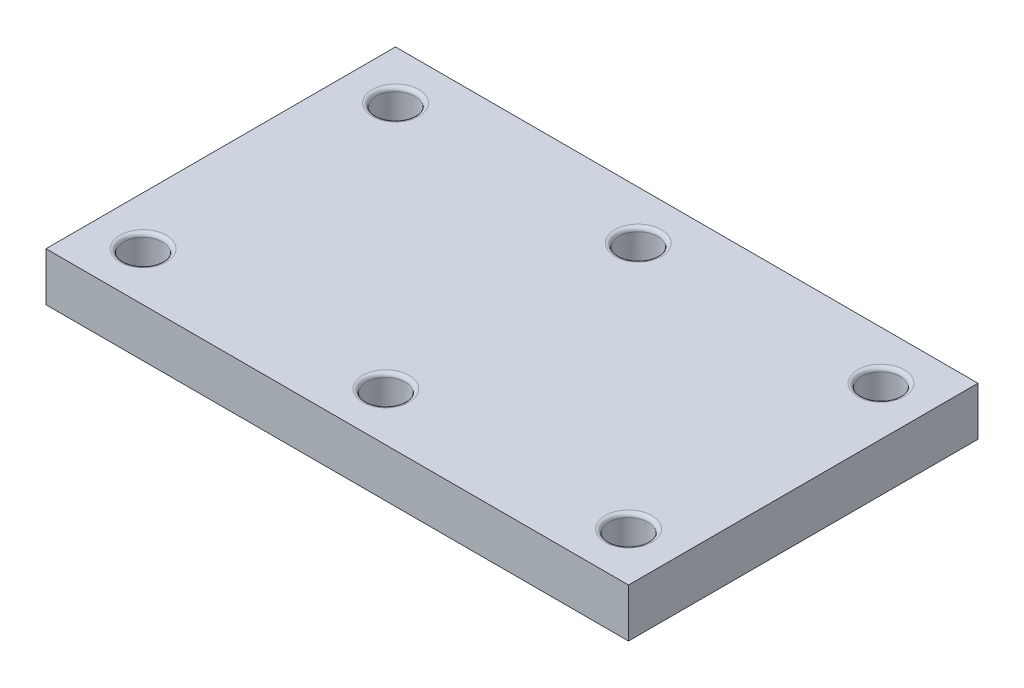
ISO-10303-21;
HEADER;
FILE_DESCRIPTION(('STEP AP214'),'2;1');
FILE_NAME('part.step','',(''),(''),'','','');
FILE_SCHEMA(('AUTOMOTIVE_DESIGN { 1 0 10303 214 1 1 1 1 }'));
ENDSEC;
DATA;
#1=APPLICATION_CONTEXT('core data for automotive mechanical design processes');
#2=APPLICATION_PROTOCOL_DEFINITION('international standard','automotive_design',2000,#1);
#3=PRODUCT_CONTEXT('',#1,'mechanical');
#4=PRODUCT('Part','Part','',(#3));
#5=PRODUCT_RELATED_PRODUCT_CATEGORY('part','',(#4));
#6=PRODUCT_DEFINITION_FORMATION('','',#4);
#7=PRODUCT_DEFINITION_CONTEXT('part definition',#1,'design');
#8=PRODUCT_DEFINITION('design','',#6,#7);
#9=PRODUCT_DEFINITION_SHAPE('','',#8);
#10=(LENGTH_UNIT() NAMED_UNIT(*) SI_UNIT(.MILLI.,.METRE.));
#11=(NAMED_UNIT(*) PLANE_ANGLE_UNIT() SI_UNIT($,.RADIAN.));
#12=(NAMED_UNIT(*) SI_UNIT($,.STERADIAN.) SOLID_ANGLE_UNIT());
#13=UNCERTAINTY_MEASURE_WITH_UNIT(LENGTH_MEASURE(1.E-05),#10,'distance_accuracy_value','');
#14=(GEOMETRIC_REPRESENTATION_CONTEXT(3) GLOBAL_UNCERTAINTY_ASSIGNED_CONTEXT((#13)) GLOBAL_UNIT_ASSIGNED_CONTEXT((#10,
#11,#12)) REPRESENTATION_CONTEXT('',''));
#15=CARTESIAN_POINT('',(0.,0.,0.));
#16=DIRECTION('',(0.,0.,1.));
#17=DIRECTION('',(1.,0.,0.));
#18=AXIS2_PLACEMENT_3D('',#15,#16,#17);
#19=CARTESIAN_POINT('',(150.,25.,90.));
#20=DIRECTION('',(-1.,0.,0.));
#21=DIRECTION('',(0.,0.,1.));
#22=AXIS2_PLACEMENT_3D('',#19,#20,#21);
#23=PLANE('',#22);
#24=DIRECTION('',(0.,0.,-1.));
#25=VECTOR('',#24,1.);
#26=CARTESIAN_POINT('',(150.,0.,90.));
#27=LINE('',#26,#25);
#28=CARTESIAN_POINT('',(150.,0.,90.));
#29=VERTEX_POINT('',#28);
#30=CARTESIAN_POINT('',(150.,0.,-90.));
#31=VERTEX_POINT('',#30);
#32=EDGE_CURVE('E101',#29,#31,#27,.T.);
#33=ORIENTED_EDGE('',*,*,#32,.T.);
#34=DIRECTION('',(0.,-1.,0.));
#35=VECTOR('',#34,1.);
#36=CARTESIAN_POINT('',(150.,25.,-90.));
#37=LINE('',#36,#35);
#38=CARTESIAN_POINT('',(150.,25.,-90.));
#39=VERTEX_POINT('',#38);
#40=EDGE_CURVE('E92',#39,#31,#37,.T.);
#41=ORIENTED_EDGE('',*,*,#40,.F.);
#42=DIRECTION('',(0.,0.,-1.));
#43=VECTOR('',#42,1.);
#44=CARTESIAN_POINT('',(150.,25.,90.));
#45=LINE('',#44,#43);
#46=CARTESIAN_POINT('',(150.,25.,90.));
#47=VERTEX_POINT('',#46);
#48=EDGE_CURVE('E86',#47,#39,#45,.T.);
#49=ORIENTED_EDGE('',*,*,#48,.F.);
#50=DIRECTION('',(0.,-1.,0.));
#51=VECTOR('',#50,1.);
#52=CARTESIAN_POINT('',(150.,25.,90.));
#53=LINE('',#52,#51);
#54=EDGE_CURVE('E97',#47,#29,#53,.T.);
#55=ORIENTED_EDGE('',*,*,#54,.T.);
#56=EDGE_LOOP('',(#33,#41,#49,#55));
#57=FACE_BOUND('',#56,.T.);
#58=ADVANCED_FACE('F33',(#57),#23,.F.);
#59=CARTESIAN_POINT('',(-150.,25.,-90.));
#60=DIRECTION('',(0.,0.,1.));
#61=DIRECTION('',(1.,0.,0.));
#62=AXIS2_PLACEMENT_3D('',#59,#60,#61);
#63=PLANE('',#62);
#64=DIRECTION('',(-1.,0.,0.));
#65=VECTOR('',#64,1.);
#66=CARTESIAN_POINT('',(-150.,0.,-90.));
#67=LINE('',#66,#65);
#68=CARTESIAN_POINT('',(-150.,0.,-90.));
#69=VERTEX_POINT('',#68);
#70=EDGE_CURVE('E91',#31,#69,#67,.T.);
#71=ORIENTED_EDGE('',*,*,#70,.T.);
#72=DIRECTION('',(0.,-1.,0.));
#73=VECTOR('',#72,1.);
#74=CARTESIAN_POINT('',(-150.,25.,-90.));
#75=LINE('',#74,#73);
#76=CARTESIAN_POINT('',(-150.,25.,-90.));
#77=VERTEX_POINT('',#76);
#78=EDGE_CURVE('E89',#77,#69,#75,.T.);
#79=ORIENTED_EDGE('',*,*,#78,.F.);
#80=DIRECTION('',(-1.,0.,0.));
#81=VECTOR('',#80,1.);
#82=CARTESIAN_POINT('',(-150.,25.,-90.));
#83=LINE('',#82,#81);
#84=EDGE_CURVE('E81',#39,#77,#83,.T.);
#85=ORIENTED_EDGE('',*,*,#84,.F.);
#86=ORIENTED_EDGE('',*,*,#40,.T.);
#87=EDGE_LOOP('',(#71,#79,#85,#86));
#88=FACE_BOUND('',#87,.T.);
#89=ADVANCED_FACE('F90',(#88),#63,.F.);
#90=CARTESIAN_POINT('',(-150.,25.,90.));
#91=DIRECTION('',(1.,0.,0.));
#92=DIRECTION('',(0.,0.,-1.));
#93=AXIS2_PLACEMENT_3D('',#90,#91,#92);
#94=PLANE('',#93);
#95=DIRECTION('',(0.,0.,1.));
#96=VECTOR('',#95,1.);
#97=CARTESIAN_POINT('',(-150.,0.,90.));
#98=LINE('',#97,#96);
#99=CARTESIAN_POINT('',(-150.,0.,90.));
#100=VERTEX_POINT('',#99);
#101=EDGE_CURVE('E67',#69,#100,#98,.T.);
#102=ORIENTED_EDGE('',*,*,#101,.T.);
#103=DIRECTION('',(0.,-1.,0.));
#104=VECTOR('',#103,1.);
#105=CARTESIAN_POINT('',(-150.,25.,90.));
#106=LINE('',#105,#104);
#107=CARTESIAN_POINT('',(-150.,25.,90.));
#108=VERTEX_POINT('',#107);
#109=EDGE_CURVE('E93',#108,#100,#106,.T.);
#110=ORIENTED_EDGE('',*,*,#109,.F.);
#111=DIRECTION('',(0.,0.,1.));
#112=VECTOR('',#111,1.);
#113=CARTESIAN_POINT('',(-150.,25.,90.));
#114=LINE('',#113,#112);
#115=EDGE_CURVE('E84',#77,#108,#114,.T.);
#116=ORIENTED_EDGE('',*,*,#115,.F.);
#117=ORIENTED_EDGE('',*,*,#78,.T.);
#118=EDGE_LOOP('',(#102,#110,#116,#117));
#119=FACE_BOUND('',#118,.T.);
#120=ADVANCED_FACE('F95',(#119),#94,.F.);
#121=CARTESIAN_POINT('',(-150.,25.,90.));
#122=DIRECTION('',(0.,0.,-1.));
#123=DIRECTION('',(-1.,0.,0.));
#124=AXIS2_PLACEMENT_3D('',#121,#122,#123);
#125=PLANE('',#124);
#126=DIRECTION('',(1.,0.,0.));
#127=VECTOR('',#126,1.);
#128=CARTESIAN_POINT('',(-150.,0.,90.));
#129=LINE('',#128,#127);
#130=EDGE_CURVE('E73',#100,#29,#129,.T.);
#131=ORIENTED_EDGE('',*,*,#130,.T.);
#132=ORIENTED_EDGE('',*,*,#54,.F.);
#133=DIRECTION('',(1.,0.,0.));
#134=VECTOR('',#133,1.);
#135=CARTESIAN_POINT('',(-150.,25.,90.));
#136=LINE('',#135,#134);
#137=EDGE_CURVE('E50',#108,#47,#136,.T.);
#138=ORIENTED_EDGE('',*,*,#137,.F.);
#139=ORIENTED_EDGE('',*,*,#109,.T.);
#140=EDGE_LOOP('',(#131,#132,#138,#139));
#141=FACE_BOUND('',#140,.T.);
#142=ADVANCED_FACE('F155',(#141),#125,.F.);
#143=CARTESIAN_POINT('',(0.,25.,0.));
#144=DIRECTION('',(0.,-1.,0.));
#145=DIRECTION('',(0.,0.,-1.));
#146=AXIS2_PLACEMENT_3D('',#143,#144,#145);
#147=PLANE('',#146);
#148=CARTESIAN_POINT('',(-125.,25.,-65.));
#149=DIRECTION('',(0.,-1.,0.));
#150=DIRECTION('',(0.,0.,-1.));
#151=AXIS2_PLACEMENT_3D('',#148,#149,#150);
#152=CIRCLE('',#151,12.);
#153=CARTESIAN_POINT('',(-125.,25.,-77.));
#154=VERTEX_POINT('',#153);
#155=EDGE_CURVE('E129',#154,#154,#152,.T.);
#156=ORIENTED_EDGE('',*,*,#155,.T.);
#157=EDGE_LOOP('',(#156));
#158=FACE_BOUND('',#157,.T.);
#159=CARTESIAN_POINT('',(0.,25.,-65.));
#160=DIRECTION('',(0.,-1.,0.));
#161=DIRECTION('',(0.,0.,-1.));
#162=AXIS2_PLACEMENT_3D('',#159,#160,#161);
#163=CIRCLE('',#162,12.);
#164=CARTESIAN_POINT('',(0.,25.,-77.));
#165=VERTEX_POINT('',#164);
#166=EDGE_CURVE('E126',#165,#165,#163,.T.);
#167=ORIENTED_EDGE('',*,*,#166,.T.);
#168=EDGE_LOOP('',(#167));
#169=FACE_BOUND('',#168,.T.);
#170=CARTESIAN_POINT('',(125.,25.,-65.));
#171=DIRECTION('',(0.,-1.,0.));
#172=DIRECTION('',(0.,0.,-1.));
#173=AXIS2_PLACEMENT_3D('',#170,#171,#172);
#174=CIRCLE('',#173,12.);
#175=CARTESIAN_POINT('',(125.,25.,-77.));
#176=VERTEX_POINT('',#175);
#177=EDGE_CURVE('E123',#176,#176,#174,.T.);
#178=ORIENTED_EDGE('',*,*,#177,.T.);
#179=EDGE_LOOP('',(#178));
#180=FACE_BOUND('',#179,.T.);
#181=CARTESIAN_POINT('',(125.,25.,65.0000000000001));
#182=DIRECTION('',(0.,-1.,0.));
#183=DIRECTION('',(0.,0.,-1.));
#184=AXIS2_PLACEMENT_3D('',#181,#182,#183);
#185=CIRCLE('',#184,12.);
#186=CARTESIAN_POINT('',(125.,25.,53.0000000000001));
#187=VERTEX_POINT('',#186);
#188=EDGE_CURVE('E120',#187,#187,#185,.T.);
#189=ORIENTED_EDGE('',*,*,#188,.T.);
#190=EDGE_LOOP('',(#189));
#191=FACE_BOUND('',#190,.T.);
#192=CARTESIAN_POINT('',(0.,25.,65.));
#193=DIRECTION('',(0.,-1.,0.));
#194=DIRECTION('',(0.,0.,-1.));
#195=AXIS2_PLACEMENT_3D('',#192,#193,#194);
#196=CIRCLE('',#195,12.);
#197=CARTESIAN_POINT('',(0.,25.,53.));
#198=VERTEX_POINT('',#197);
#199=EDGE_CURVE('E117',#198,#198,#196,.T.);
#200=ORIENTED_EDGE('',*,*,#199,.T.);
#201=EDGE_LOOP('',(#200));
#202=FACE_BOUND('',#201,.T.);
#203=CARTESIAN_POINT('',(-125.,25.,65.));
#204=DIRECTION('',(0.,-1.,0.));
#205=DIRECTION('',(0.,0.,-1.));
#206=AXIS2_PLACEMENT_3D('',#203,#204,#205);
#207=CIRCLE('',#206,12.);
#208=CARTESIAN_POINT('',(-125.,25.,53.));
#209=VERTEX_POINT('',#208);
#210=EDGE_CURVE('E114',#209,#209,#207,.T.);
#211=ORIENTED_EDGE('',*,*,#210,.T.);
#212=EDGE_LOOP('',(#211));
#213=FACE_BOUND('',#212,.T.);
#214=ORIENTED_EDGE('',*,*,#48,.T.);
#215=ORIENTED_EDGE('',*,*,#84,.T.);
#216=ORIENTED_EDGE('',*,*,#115,.T.);
#217=ORIENTED_EDGE('',*,*,#137,.T.);
#218=EDGE_LOOP('',(#214,#215,#216,#217));
#219=FACE_BOUND('',#218,.T.);
#220=ADVANCED_FACE('F82',(#158,#169,#180,#191,#202,#213,#219),#147,.F.);
#221=CARTESIAN_POINT('',(0.,0.,0.));
#222=DIRECTION('',(0.,-1.,0.));
#223=DIRECTION('',(0.,0.,-1.));
#224=AXIS2_PLACEMENT_3D('',#221,#222,#223);
#225=PLANE('',#224);
#226=CARTESIAN_POINT('',(-125.,0.,65.));
#227=DIRECTION('',(0.,-1.,0.));
#228=DIRECTION('',(0.,0.,-1.));
#229=AXIS2_PLACEMENT_3D('',#226,#227,#228);
#230=CIRCLE('',#229,9.99999999999999);
#231=CARTESIAN_POINT('',(-125.,0.,55.));
#232=VERTEX_POINT('',#231);
#233=EDGE_CURVE('E208',#232,#232,#230,.T.);
#234=ORIENTED_EDGE('',*,*,#233,.F.);
#235=EDGE_LOOP('',(#234));
#236=FACE_BOUND('',#235,.T.);
#237=CARTESIAN_POINT('',(0.,0.,65.));
#238=DIRECTION('',(0.,-1.,0.));
#239=DIRECTION('',(0.,0.,-1.));
#240=AXIS2_PLACEMENT_3D('',#237,#238,#239);
#241=CIRCLE('',#240,10.);
#242=CARTESIAN_POINT('',(0.,0.,55.));
#243=VERTEX_POINT('',#242);
#244=EDGE_CURVE('E205',#243,#243,#241,.T.);
#245=ORIENTED_EDGE('',*,*,#244,.F.);
#246=EDGE_LOOP('',(#245));
#247=FACE_BOUND('',#246,.T.);
#248=CARTESIAN_POINT('',(125.,0.,65.0000000000001));
#249=DIRECTION('',(0.,-1.,0.));
#250=DIRECTION('',(0.,0.,-1.));
#251=AXIS2_PLACEMENT_3D('',#248,#249,#250);
#252=CIRCLE('',#251,10.);
#253=CARTESIAN_POINT('',(125.,0.,55.0000000000001));
#254=VERTEX_POINT('',#253);
#255=EDGE_CURVE('E203',#254,#254,#252,.T.);
#256=ORIENTED_EDGE('',*,*,#255,.F.);
#257=EDGE_LOOP('',(#256));
#258=FACE_BOUND('',#257,.T.);
#259=CARTESIAN_POINT('',(125.,0.,-65.));
#260=DIRECTION('',(0.,1.,0.));
#261=DIRECTION('',(0.,0.,1.));
#262=AXIS2_PLACEMENT_3D('',#259,#260,#261);
#263=CIRCLE('',#262,10.);
#264=CARTESIAN_POINT('',(125.,0.,-55.));
#265=VERTEX_POINT('',#264);
#266=EDGE_CURVE('E212',#265,#265,#263,.T.);
#267=ORIENTED_EDGE('',*,*,#266,.T.);
#268=EDGE_LOOP('',(#267));
#269=FACE_BOUND('',#268,.T.);
#270=CARTESIAN_POINT('',(-125.,0.,-65.));
#271=DIRECTION('',(0.,1.,0.));
#272=DIRECTION('',(0.,0.,1.));
#273=AXIS2_PLACEMENT_3D('',#270,#271,#272);
#274=CIRCLE('',#273,9.99999999999999);
#275=CARTESIAN_POINT('',(-125.,0.,-55.));
#276=VERTEX_POINT('',#275);
#277=EDGE_CURVE('E215',#276,#276,#274,.T.);
#278=ORIENTED_EDGE('',*,*,#277,.T.);
#279=EDGE_LOOP('',(#278));
#280=FACE_BOUND('',#279,.T.);
#281=CARTESIAN_POINT('',(0.,0.,-65.));
#282=DIRECTION('',(0.,1.,0.));
#283=DIRECTION('',(0.,0.,1.));
#284=AXIS2_PLACEMENT_3D('',#281,#282,#283);
#285=CIRCLE('',#284,10.);
#286=CARTESIAN_POINT('',(0.,0.,-55.));
#287=VERTEX_POINT('',#286);
#288=EDGE_CURVE('E104',#287,#287,#285,.T.);
#289=ORIENTED_EDGE('',*,*,#288,.T.);
#290=EDGE_LOOP('',(#289));
#291=FACE_BOUND('',#290,.T.);
#292=ORIENTED_EDGE('',*,*,#32,.F.);
#293=ORIENTED_EDGE('',*,*,#130,.F.);
#294=ORIENTED_EDGE('',*,*,#101,.F.);
#295=ORIENTED_EDGE('',*,*,#70,.F.);
#296=EDGE_LOOP('',(#292,#293,#294,#295));
#297=FACE_BOUND('',#296,.T.);
#298=ADVANCED_FACE('F154',(#236,#247,#258,#269,#280,#291,#297),#225,.T.);
#299=CARTESIAN_POINT('',(0.,212.,-65.));
#300=DIRECTION('',(0.,-1.,0.));
#301=DIRECTION('',(0.,0.,-1.));
#302=AXIS2_PLACEMENT_3D('',#299,#300,#301);
#303=CYLINDRICAL_SURFACE('',#302,10.);
#304=CARTESIAN_POINT('',(0.,23.,-65.));
#305=DIRECTION('',(0.,-1.,0.));
#306=DIRECTION('',(0.,0.,-1.));
#307=AXIS2_PLACEMENT_3D('',#304,#305,#306);
#308=CIRCLE('',#307,10.);
#309=CARTESIAN_POINT('',(0.,23.,-75.));
#310=VERTEX_POINT('',#309);
#311=EDGE_CURVE('E132',#310,#310,#308,.F.);
#312=ORIENTED_EDGE('',*,*,#311,.T.);
#313=EDGE_LOOP('',(#312));
#314=FACE_BOUND('',#313,.T.);
#315=ORIENTED_EDGE('',*,*,#288,.F.);
#316=EDGE_LOOP('',(#315));
#317=FACE_BOUND('',#316,.T.);
#318=ADVANCED_FACE('F223',(#314,#317),#303,.F.);
#319=CARTESIAN_POINT('',(-125.,159.,-65.));
#320=DIRECTION('',(0.,-1.,0.));
#321=DIRECTION('',(0.,0.,-1.));
#322=AXIS2_PLACEMENT_3D('',#319,#320,#321);
#323=CYLINDRICAL_SURFACE('',#322,9.99999999999999);
#324=CARTESIAN_POINT('',(-125.,23.,-65.));
#325=DIRECTION('',(0.,-1.,0.));
#326=DIRECTION('',(0.,0.,-1.));
#327=AXIS2_PLACEMENT_3D('',#324,#325,#326);
#328=CIRCLE('',#327,9.99999999999999);
#329=CARTESIAN_POINT('',(-125.,23.,-75.));
#330=VERTEX_POINT('',#329);
#331=EDGE_CURVE('E111',#330,#330,#328,.F.);
#332=ORIENTED_EDGE('',*,*,#331,.T.);
#333=EDGE_LOOP('',(#332));
#334=FACE_BOUND('',#333,.T.);
#335=ORIENTED_EDGE('',*,*,#277,.F.);
#336=EDGE_LOOP('',(#335));
#337=FACE_BOUND('',#336,.T.);
#338=ADVANCED_FACE('F225',(#334,#337),#323,.F.);
#339=CARTESIAN_POINT('',(125.,209.,-65.));
#340=DIRECTION('',(0.,-1.,0.));
#341=DIRECTION('',(0.,0.,-1.));
#342=AXIS2_PLACEMENT_3D('',#339,#340,#341);
#343=CYLINDRICAL_SURFACE('',#342,10.);
#344=CARTESIAN_POINT('',(125.,23.,-65.));
#345=DIRECTION('',(0.,-1.,0.));
#346=DIRECTION('',(0.,0.,-1.));
#347=AXIS2_PLACEMENT_3D('',#344,#345,#346);
#348=CIRCLE('',#347,10.);
#349=CARTESIAN_POINT('',(125.,23.,-75.));
#350=VERTEX_POINT('',#349);
#351=EDGE_CURVE('E135',#350,#350,#348,.F.);
#352=ORIENTED_EDGE('',*,*,#351,.T.);
#353=EDGE_LOOP('',(#352));
#354=FACE_BOUND('',#353,.T.);
#355=ORIENTED_EDGE('',*,*,#266,.F.);
#356=EDGE_LOOP('',(#355));
#357=FACE_BOUND('',#356,.T.);
#358=ADVANCED_FACE('F199',(#354,#357),#343,.F.);
#359=CARTESIAN_POINT('',(125.,305.,65.0000000000001));
#360=DIRECTION('',(0.,-1.,0.));
#361=DIRECTION('',(0.,0.,-1.));
#362=AXIS2_PLACEMENT_3D('',#359,#360,#361);
#363=CYLINDRICAL_SURFACE('',#362,10.);
#364=CARTESIAN_POINT('',(125.,23.,65.0000000000001));
#365=DIRECTION('',(0.,-1.,0.));
#366=DIRECTION('',(0.,0.,-1.));
#367=AXIS2_PLACEMENT_3D('',#364,#365,#366);
#368=CIRCLE('',#367,10.);
#369=CARTESIAN_POINT('',(125.,23.,55.0000000000001));
#370=VERTEX_POINT('',#369);
#371=EDGE_CURVE('E138',#370,#370,#368,.F.);
#372=ORIENTED_EDGE('',*,*,#371,.T.);
#373=EDGE_LOOP('',(#372));
#374=FACE_BOUND('',#373,.T.);
#375=ORIENTED_EDGE('',*,*,#255,.T.);
#376=EDGE_LOOP('',(#375));
#377=FACE_BOUND('',#376,.T.);
#378=ADVANCED_FACE('F196',(#374,#377),#363,.F.);
#379=CARTESIAN_POINT('',(0.,305.,65.));
#380=DIRECTION('',(0.,-1.,0.));
#381=DIRECTION('',(0.,0.,-1.));
#382=AXIS2_PLACEMENT_3D('',#379,#380,#381);
#383=CYLINDRICAL_SURFACE('',#382,10.);
#384=CARTESIAN_POINT('',(0.,23.,65.));
#385=DIRECTION('',(0.,-1.,0.));
#386=DIRECTION('',(0.,0.,-1.));
#387=AXIS2_PLACEMENT_3D('',#384,#385,#386);
#388=CIRCLE('',#387,10.);
#389=CARTESIAN_POINT('',(0.,23.,55.));
#390=VERTEX_POINT('',#389);
#391=EDGE_CURVE('E42',#390,#390,#388,.F.);
#392=ORIENTED_EDGE('',*,*,#391,.T.);
#393=EDGE_LOOP('',(#392));
#394=FACE_BOUND('',#393,.T.);
#395=ORIENTED_EDGE('',*,*,#244,.T.);
#396=EDGE_LOOP('',(#395));
#397=FACE_BOUND('',#396,.T.);
#398=ADVANCED_FACE('F143',(#394,#397),#383,.F.);
#399=CARTESIAN_POINT('',(-125.,305.,65.));
#400=DIRECTION('',(0.,-1.,0.));
#401=DIRECTION('',(0.,0.,-1.));
#402=AXIS2_PLACEMENT_3D('',#399,#400,#401);
#403=CYLINDRICAL_SURFACE('',#402,9.99999999999999);
#404=CARTESIAN_POINT('',(-125.,23.,65.));
#405=DIRECTION('',(0.,-1.,0.));
#406=DIRECTION('',(0.,0.,-1.));
#407=AXIS2_PLACEMENT_3D('',#404,#405,#406);
#408=CIRCLE('',#407,9.99999999999999);
#409=CARTESIAN_POINT('',(-125.,23.,55.));
#410=VERTEX_POINT('',#409);
#411=EDGE_CURVE('E11',#410,#410,#408,.F.);
#412=ORIENTED_EDGE('',*,*,#411,.T.);
#413=EDGE_LOOP('',(#412));
#414=FACE_BOUND('',#413,.T.);
#415=ORIENTED_EDGE('',*,*,#233,.T.);
#416=EDGE_LOOP('',(#415));
#417=FACE_BOUND('',#416,.T.);
#418=ADVANCED_FACE('F178',(#414,#417),#403,.F.);
#419=CARTESIAN_POINT('',(-125.,23.,-65.));
#420=DIRECTION('',(0.,-1.,0.));
#421=DIRECTION('',(0.,0.,-1.));
#422=AXIS2_PLACEMENT_3D('',#419,#420,#421);
#423=TOROIDAL_SURFACE('',#422,12.,2.);
#424=ORIENTED_EDGE('',*,*,#155,.F.);
#425=EDGE_LOOP('',(#424));
#426=FACE_BOUND('',#425,.T.);
#427=ORIENTED_EDGE('',*,*,#331,.F.);
#428=EDGE_LOOP('',(#427));
#429=FACE_BOUND('',#428,.T.);
#430=ADVANCED_FACE('F174',(#426,#429),#423,.T.);
#431=CARTESIAN_POINT('',(0.,23.,-65.));
#432=DIRECTION('',(0.,-1.,0.));
#433=DIRECTION('',(0.,0.,-1.));
#434=AXIS2_PLACEMENT_3D('',#431,#432,#433);
#435=TOROIDAL_SURFACE('',#434,12.,2.);
#436=ORIENTED_EDGE('',*,*,#166,.F.);
#437=EDGE_LOOP('',(#436));
#438=FACE_BOUND('',#437,.T.);
#439=ORIENTED_EDGE('',*,*,#311,.F.);
#440=EDGE_LOOP('',(#439));
#441=FACE_BOUND('',#440,.T.);
#442=ADVANCED_FACE('F177',(#438,#441),#435,.T.);
#443=CARTESIAN_POINT('',(125.,23.,-65.));
#444=DIRECTION('',(0.,-1.,0.));
#445=DIRECTION('',(0.,0.,-1.));
#446=AXIS2_PLACEMENT_3D('',#443,#444,#445);
#447=TOROIDAL_SURFACE('',#446,12.,2.);
#448=ORIENTED_EDGE('',*,*,#177,.F.);
#449=EDGE_LOOP('',(#448));
#450=FACE_BOUND('',#449,.T.);
#451=ORIENTED_EDGE('',*,*,#351,.F.);
#452=EDGE_LOOP('',(#451));
#453=FACE_BOUND('',#452,.T.);
#454=ADVANCED_FACE('F182',(#450,#453),#447,.T.);
#455=CARTESIAN_POINT('',(125.,23.,65.0000000000001));
#456=DIRECTION('',(0.,-1.,0.));
#457=DIRECTION('',(0.,0.,-1.));
#458=AXIS2_PLACEMENT_3D('',#455,#456,#457);
#459=TOROIDAL_SURFACE('',#458,12.,2.);
#460=ORIENTED_EDGE('',*,*,#371,.F.);
#461=EDGE_LOOP('',(#460));
#462=FACE_BOUND('',#461,.T.);
#463=ORIENTED_EDGE('',*,*,#188,.F.);
#464=EDGE_LOOP('',(#463));
#465=FACE_BOUND('',#464,.T.);
#466=ADVANCED_FACE('F149',(#462,#465),#459,.T.);
#467=CARTESIAN_POINT('',(0.,23.,65.));
#468=DIRECTION('',(0.,-1.,0.));
#469=DIRECTION('',(0.,0.,-1.));
#470=AXIS2_PLACEMENT_3D('',#467,#468,#469);
#471=TOROIDAL_SURFACE('',#470,12.,2.);
#472=ORIENTED_EDGE('',*,*,#391,.F.);
#473=EDGE_LOOP('',(#472));
#474=FACE_BOUND('',#473,.T.);
#475=ORIENTED_EDGE('',*,*,#199,.F.);
#476=EDGE_LOOP('',(#475));
#477=FACE_BOUND('',#476,.T.);
#478=ADVANCED_FACE('F146',(#474,#477),#471,.T.);
#479=CARTESIAN_POINT('',(-125.,23.,65.));
#480=DIRECTION('',(0.,-1.,0.));
#481=DIRECTION('',(0.,0.,-1.));
#482=AXIS2_PLACEMENT_3D('',#479,#480,#481);
#483=TOROIDAL_SURFACE('',#482,12.,2.);
#484=ORIENTED_EDGE('',*,*,#411,.F.);
#485=EDGE_LOOP('',(#484));
#486=FACE_BOUND('',#485,.T.);
#487=ORIENTED_EDGE('',*,*,#210,.F.);
#488=EDGE_LOOP('',(#487));
#489=FACE_BOUND('',#488,.T.);
#490=ADVANCED_FACE('F35',(#486,#489),#483,.T.);
#491=CLOSED_SHELL('',(#58,#89,#120,#142,#220,#298,#318,#338,#358,#378,#398,#418,#430,#442,#454,
#466,#478,#490));
#492=MANIFOLD_SOLID_BREP('B2',#491);
#493=ADVANCED_BREP_SHAPE_REPRESENTATION('',(#18,#492),#14);
#494=SHAPE_DEFINITION_REPRESENTATION(#9,#493);
ENDSEC;
END-ISO-10303-21;
